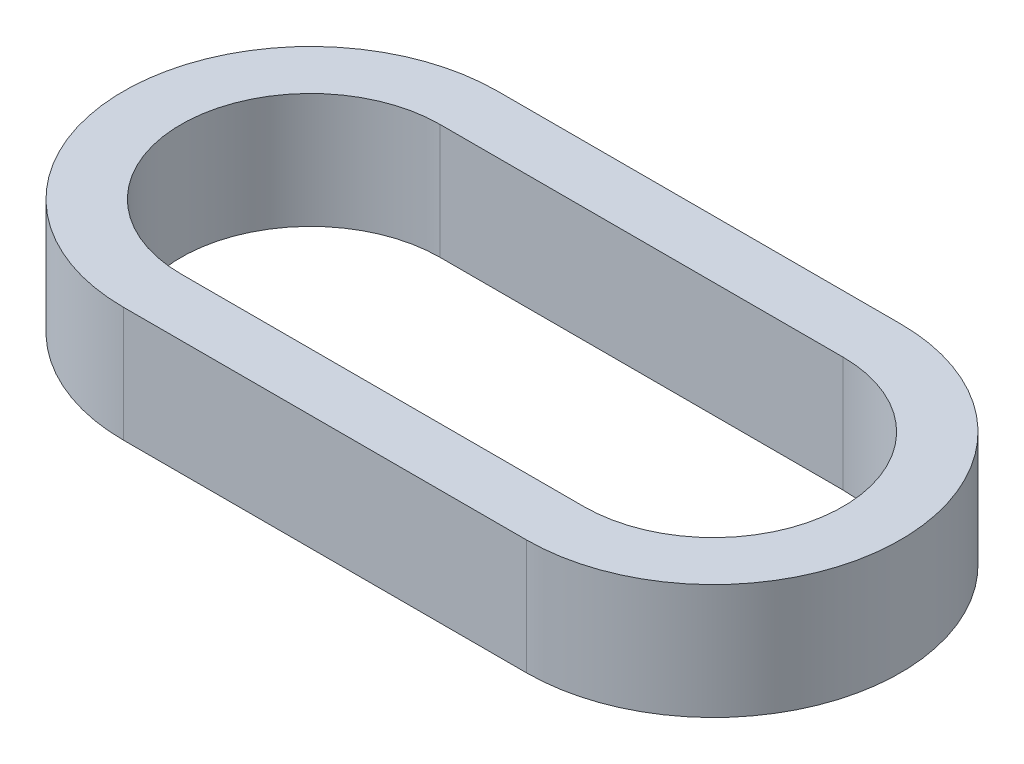
ISO-10303-21;
HEADER;
FILE_DESCRIPTION(('STEP AP214'),'2;1');
FILE_NAME('part.step','',(''),(''),'','','');
FILE_SCHEMA(('AUTOMOTIVE_DESIGN { 1 0 10303 214 1 1 1 1 }'));
ENDSEC;
DATA;
#1=APPLICATION_CONTEXT('core data for automotive mechanical design processes');
#2=APPLICATION_PROTOCOL_DEFINITION('international standard','automotive_design',2000,#1);
#3=PRODUCT_CONTEXT('',#1,'mechanical');
#4=PRODUCT('Part','Part','',(#3));
#5=PRODUCT_RELATED_PRODUCT_CATEGORY('part','',(#4));
#6=PRODUCT_DEFINITION_FORMATION('','',#4);
#7=PRODUCT_DEFINITION_CONTEXT('part definition',#1,'design');
#8=PRODUCT_DEFINITION('design','',#6,#7);
#9=PRODUCT_DEFINITION_SHAPE('','',#8);
#10=(LENGTH_UNIT() NAMED_UNIT(*) SI_UNIT(.MILLI.,.METRE.));
#11=(NAMED_UNIT(*) PLANE_ANGLE_UNIT() SI_UNIT($,.RADIAN.));
#12=(NAMED_UNIT(*) SI_UNIT($,.STERADIAN.) SOLID_ANGLE_UNIT());
#13=UNCERTAINTY_MEASURE_WITH_UNIT(LENGTH_MEASURE(1.E-05),#10,'distance_accuracy_value','');
#14=(GEOMETRIC_REPRESENTATION_CONTEXT(3) GLOBAL_UNCERTAINTY_ASSIGNED_CONTEXT((#13)) GLOBAL_UNIT_ASSIGNED_CONTEXT((#10,
#11,#12)) REPRESENTATION_CONTEXT('',''));
#15=CARTESIAN_POINT('',(0.,0.,0.));
#16=DIRECTION('',(0.,0.,1.));
#17=DIRECTION('',(1.,0.,0.));
#18=AXIS2_PLACEMENT_3D('',#15,#16,#17);
#19=CARTESIAN_POINT('',(-3.5,2.,0.));
#20=DIRECTION('',(0.,1.,0.));
#21=DIRECTION('',(0.,0.,1.));
#22=AXIS2_PLACEMENT_3D('',#19,#20,#21);
#23=PLANE('',#22);
#24=CARTESIAN_POINT('',(-3.5,2.,0.));
#25=DIRECTION('',(0.,1.,0.));
#26=DIRECTION('',(1.,0.,0.));
#27=AXIS2_PLACEMENT_3D('',#24,#25,#26);
#28=CIRCLE('',#27,3.25);
#29=CARTESIAN_POINT('',(-3.5,2.,-3.25));
#30=VERTEX_POINT('',#29);
#31=CARTESIAN_POINT('',(-3.5,2.,3.25));
#32=VERTEX_POINT('',#31);
#33=EDGE_CURVE('E160',#30,#32,#28,.T.);
#34=ORIENTED_EDGE('',*,*,#33,.T.);
#35=DIRECTION('',(1.,0.,0.));
#36=VECTOR('',#35,1.);
#37=CARTESIAN_POINT('',(-3.5,2.,3.25));
#38=LINE('',#37,#36);
#39=CARTESIAN_POINT('',(3.5,2.,3.25));
#40=VERTEX_POINT('',#39);
#41=EDGE_CURVE('E163',#32,#40,#38,.T.);
#42=ORIENTED_EDGE('',*,*,#41,.T.);
#43=CARTESIAN_POINT('',(3.5,2.,0.));
#44=DIRECTION('',(0.,1.,0.));
#45=DIRECTION('',(1.,0.,0.));
#46=AXIS2_PLACEMENT_3D('',#43,#44,#45);
#47=CIRCLE('',#46,3.25);
#48=CARTESIAN_POINT('',(3.5,2.,-3.25));
#49=VERTEX_POINT('',#48);
#50=EDGE_CURVE('E166',#40,#49,#47,.T.);
#51=ORIENTED_EDGE('',*,*,#50,.T.);
#52=DIRECTION('',(-1.,0.,0.));
#53=VECTOR('',#52,1.);
#54=CARTESIAN_POINT('',(-3.5,2.,-3.25));
#55=LINE('',#54,#53);
#56=EDGE_CURVE('E168',#49,#30,#55,.T.);
#57=ORIENTED_EDGE('',*,*,#56,.T.);
#58=EDGE_LOOP('',(#34,#42,#51,#57));
#59=FACE_BOUND('',#58,.T.);
#60=DIRECTION('',(1.,0.,0.));
#61=VECTOR('',#60,1.);
#62=CARTESIAN_POINT('',(-3.5,2.,2.25));
#63=LINE('',#62,#61);
#64=CARTESIAN_POINT('',(-3.5,2.,2.25));
#65=VERTEX_POINT('',#64);
#66=CARTESIAN_POINT('',(3.5,2.,2.25));
#67=VERTEX_POINT('',#66);
#68=EDGE_CURVE('E132',#65,#67,#63,.T.);
#69=ORIENTED_EDGE('',*,*,#68,.F.);
#70=CARTESIAN_POINT('',(-3.5,2.,0.));
#71=DIRECTION('',(0.,1.,0.));
#72=DIRECTION('',(0.,0.,1.));
#73=AXIS2_PLACEMENT_3D('',#70,#71,#72);
#74=CIRCLE('',#73,2.25);
#75=CARTESIAN_POINT('',(-3.5,2.,-2.25));
#76=VERTEX_POINT('',#75);
#77=EDGE_CURVE('E124',#76,#65,#74,.T.);
#78=ORIENTED_EDGE('',*,*,#77,.F.);
#79=DIRECTION('',(-1.,0.,0.));
#80=VECTOR('',#79,1.);
#81=CARTESIAN_POINT('',(-3.5,2.,-2.25));
#82=LINE('',#81,#80);
#83=CARTESIAN_POINT('',(3.5,2.,-2.25));
#84=VERTEX_POINT('',#83);
#85=EDGE_CURVE('E146',#84,#76,#82,.T.);
#86=ORIENTED_EDGE('',*,*,#85,.F.);
#87=CARTESIAN_POINT('',(3.5,2.,0.));
#88=DIRECTION('',(0.,1.,0.));
#89=DIRECTION('',(0.,0.,1.));
#90=AXIS2_PLACEMENT_3D('',#87,#88,#89);
#91=CIRCLE('',#90,2.25);
#92=EDGE_CURVE('E144',#67,#84,#91,.T.);
#93=ORIENTED_EDGE('',*,*,#92,.F.);
#94=EDGE_LOOP('',(#69,#78,#86,#93));
#95=FACE_BOUND('',#94,.T.);
#96=ADVANCED_FACE('F59',(#59,#95),#23,.T.);
#97=CARTESIAN_POINT('',(-3.5,0.,0.));
#98=DIRECTION('',(0.,1.,0.));
#99=DIRECTION('',(0.,0.,1.));
#100=AXIS2_PLACEMENT_3D('',#97,#98,#99);
#101=PLANE('',#100);
#102=CARTESIAN_POINT('',(-3.5,0.,0.));
#103=DIRECTION('',(0.,1.,0.));
#104=DIRECTION('',(1.,0.,0.));
#105=AXIS2_PLACEMENT_3D('',#102,#103,#104);
#106=CIRCLE('',#105,3.25);
#107=CARTESIAN_POINT('',(-3.5,0.,-3.25));
#108=VERTEX_POINT('',#107);
#109=CARTESIAN_POINT('',(-3.5,0.,3.25));
#110=VERTEX_POINT('',#109);
#111=EDGE_CURVE('E140',#108,#110,#106,.T.);
#112=ORIENTED_EDGE('',*,*,#111,.F.);
#113=DIRECTION('',(-1.,0.,0.));
#114=VECTOR('',#113,1.);
#115=CARTESIAN_POINT('',(-3.5,0.,-3.25));
#116=LINE('',#115,#114);
#117=CARTESIAN_POINT('',(3.5,0.,-3.25));
#118=VERTEX_POINT('',#117);
#119=EDGE_CURVE('E164',#118,#108,#116,.T.);
#120=ORIENTED_EDGE('',*,*,#119,.F.);
#121=CARTESIAN_POINT('',(3.5,0.,0.));
#122=DIRECTION('',(0.,1.,0.));
#123=DIRECTION('',(1.,0.,0.));
#124=AXIS2_PLACEMENT_3D('',#121,#122,#123);
#125=CIRCLE('',#124,3.25);
#126=CARTESIAN_POINT('',(3.5,0.,3.25));
#127=VERTEX_POINT('',#126);
#128=EDGE_CURVE('E175',#127,#118,#125,.T.);
#129=ORIENTED_EDGE('',*,*,#128,.F.);
#130=DIRECTION('',(1.,0.,0.));
#131=VECTOR('',#130,1.);
#132=CARTESIAN_POINT('',(-3.5,0.,3.25));
#133=LINE('',#132,#131);
#134=EDGE_CURVE('E173',#110,#127,#133,.T.);
#135=ORIENTED_EDGE('',*,*,#134,.F.);
#136=EDGE_LOOP('',(#112,#120,#129,#135));
#137=FACE_BOUND('',#136,.T.);
#138=CARTESIAN_POINT('',(-3.5,0.,0.));
#139=DIRECTION('',(0.,1.,0.));
#140=DIRECTION('',(0.,0.,1.));
#141=AXIS2_PLACEMENT_3D('',#138,#139,#140);
#142=CIRCLE('',#141,2.25);
#143=CARTESIAN_POINT('',(-3.5,0.,-2.25));
#144=VERTEX_POINT('',#143);
#145=CARTESIAN_POINT('',(-3.5,0.,2.25));
#146=VERTEX_POINT('',#145);
#147=EDGE_CURVE('E82',#144,#146,#142,.T.);
#148=ORIENTED_EDGE('',*,*,#147,.T.);
#149=DIRECTION('',(1.,0.,0.));
#150=VECTOR('',#149,1.);
#151=CARTESIAN_POINT('',(-3.5,0.,2.25));
#152=LINE('',#151,#150);
#153=CARTESIAN_POINT('',(3.5,0.,2.25));
#154=VERTEX_POINT('',#153);
#155=EDGE_CURVE('E139',#146,#154,#152,.T.);
#156=ORIENTED_EDGE('',*,*,#155,.T.);
#157=CARTESIAN_POINT('',(3.5,0.,0.));
#158=DIRECTION('',(0.,1.,0.));
#159=DIRECTION('',(0.,0.,1.));
#160=AXIS2_PLACEMENT_3D('',#157,#158,#159);
#161=CIRCLE('',#160,2.25);
#162=CARTESIAN_POINT('',(3.5,0.,-2.25));
#163=VERTEX_POINT('',#162);
#164=EDGE_CURVE('E152',#154,#163,#161,.T.);
#165=ORIENTED_EDGE('',*,*,#164,.T.);
#166=DIRECTION('',(-1.,0.,0.));
#167=VECTOR('',#166,1.);
#168=CARTESIAN_POINT('',(-3.5,0.,-2.25));
#169=LINE('',#168,#167);
#170=EDGE_CURVE('E133',#163,#144,#169,.T.);
#171=ORIENTED_EDGE('',*,*,#170,.T.);
#172=EDGE_LOOP('',(#148,#156,#165,#171));
#173=FACE_BOUND('',#172,.T.);
#174=ADVANCED_FACE('F193',(#137,#173),#101,.F.);
#175=CARTESIAN_POINT('',(-3.5,2.,0.));
#176=DIRECTION('',(0.,-1.,0.));
#177=DIRECTION('',(0.,0.,-1.));
#178=AXIS2_PLACEMENT_3D('',#175,#176,#177);
#179=CYLINDRICAL_SURFACE('',#178,3.25);
#180=ORIENTED_EDGE('',*,*,#111,.T.);
#181=DIRECTION('',(0.,-1.,0.));
#182=VECTOR('',#181,1.);
#183=CARTESIAN_POINT('',(-3.5,2.,3.25));
#184=LINE('',#183,#182);
#185=EDGE_CURVE('E12',#32,#110,#184,.T.);
#186=ORIENTED_EDGE('',*,*,#185,.F.);
#187=ORIENTED_EDGE('',*,*,#33,.F.);
#188=DIRECTION('',(0.,-1.,0.));
#189=VECTOR('',#188,1.);
#190=CARTESIAN_POINT('',(-3.5,2.,-3.25));
#191=LINE('',#190,#189);
#192=EDGE_CURVE('E170',#30,#108,#191,.T.);
#193=ORIENTED_EDGE('',*,*,#192,.T.);
#194=EDGE_LOOP('',(#180,#186,#187,#193));
#195=FACE_BOUND('',#194,.T.);
#196=ADVANCED_FACE('F61',(#195),#179,.T.);
#197=CARTESIAN_POINT('',(-3.5,2.,3.25));
#198=DIRECTION('',(0.,0.,-1.));
#199=DIRECTION('',(-1.,0.,0.));
#200=AXIS2_PLACEMENT_3D('',#197,#198,#199);
#201=PLANE('',#200);
#202=ORIENTED_EDGE('',*,*,#134,.T.);
#203=DIRECTION('',(0.,-1.,0.));
#204=VECTOR('',#203,1.);
#205=CARTESIAN_POINT('',(3.5,2.,3.25));
#206=LINE('',#205,#204);
#207=EDGE_CURVE('E67',#40,#127,#206,.T.);
#208=ORIENTED_EDGE('',*,*,#207,.F.);
#209=ORIENTED_EDGE('',*,*,#41,.F.);
#210=ORIENTED_EDGE('',*,*,#185,.T.);
#211=EDGE_LOOP('',(#202,#208,#209,#210));
#212=FACE_BOUND('',#211,.T.);
#213=ADVANCED_FACE('F203',(#212),#201,.F.);
#214=CARTESIAN_POINT('',(3.5,2.,0.));
#215=DIRECTION('',(0.,-1.,0.));
#216=DIRECTION('',(0.,0.,-1.));
#217=AXIS2_PLACEMENT_3D('',#214,#215,#216);
#218=CYLINDRICAL_SURFACE('',#217,3.25);
#219=ORIENTED_EDGE('',*,*,#128,.T.);
#220=DIRECTION('',(0.,-1.,0.));
#221=VECTOR('',#220,1.);
#222=CARTESIAN_POINT('',(3.5,2.,-3.25));
#223=LINE('',#222,#221);
#224=EDGE_CURVE('E180',#49,#118,#223,.T.);
#225=ORIENTED_EDGE('',*,*,#224,.F.);
#226=ORIENTED_EDGE('',*,*,#50,.F.);
#227=ORIENTED_EDGE('',*,*,#207,.T.);
#228=EDGE_LOOP('',(#219,#225,#226,#227));
#229=FACE_BOUND('',#228,.T.);
#230=ADVANCED_FACE('F187',(#229),#218,.T.);
#231=CARTESIAN_POINT('',(-3.5,2.,-3.25));
#232=DIRECTION('',(0.,0.,1.));
#233=DIRECTION('',(1.,0.,0.));
#234=AXIS2_PLACEMENT_3D('',#231,#232,#233);
#235=PLANE('',#234);
#236=ORIENTED_EDGE('',*,*,#119,.T.);
#237=ORIENTED_EDGE('',*,*,#192,.F.);
#238=ORIENTED_EDGE('',*,*,#56,.F.);
#239=ORIENTED_EDGE('',*,*,#224,.T.);
#240=EDGE_LOOP('',(#236,#237,#238,#239));
#241=FACE_BOUND('',#240,.T.);
#242=ADVANCED_FACE('F197',(#241),#235,.F.);
#243=CARTESIAN_POINT('',(-3.5,2.,0.));
#244=DIRECTION('',(0.,-1.,0.));
#245=DIRECTION('',(0.,0.,-1.));
#246=AXIS2_PLACEMENT_3D('',#243,#244,#245);
#247=CYLINDRICAL_SURFACE('',#246,2.25);
#248=ORIENTED_EDGE('',*,*,#147,.F.);
#249=DIRECTION('',(0.,-1.,0.));
#250=VECTOR('',#249,1.);
#251=CARTESIAN_POINT('',(-3.5,2.,-2.25));
#252=LINE('',#251,#250);
#253=EDGE_CURVE('E128',#76,#144,#252,.T.);
#254=ORIENTED_EDGE('',*,*,#253,.F.);
#255=ORIENTED_EDGE('',*,*,#77,.T.);
#256=DIRECTION('',(0.,-1.,0.));
#257=VECTOR('',#256,1.);
#258=CARTESIAN_POINT('',(-3.5,2.,2.25));
#259=LINE('',#258,#257);
#260=EDGE_CURVE('E127',#65,#146,#259,.T.);
#261=ORIENTED_EDGE('',*,*,#260,.T.);
#262=EDGE_LOOP('',(#248,#254,#255,#261));
#263=FACE_BOUND('',#262,.T.);
#264=ADVANCED_FACE('F126',(#263),#247,.F.);
#265=CARTESIAN_POINT('',(-3.5,2.,2.25));
#266=DIRECTION('',(0.,0.,-1.));
#267=DIRECTION('',(-1.,0.,0.));
#268=AXIS2_PLACEMENT_3D('',#265,#266,#267);
#269=PLANE('',#268);
#270=ORIENTED_EDGE('',*,*,#155,.F.);
#271=ORIENTED_EDGE('',*,*,#260,.F.);
#272=ORIENTED_EDGE('',*,*,#68,.T.);
#273=DIRECTION('',(0.,-1.,0.));
#274=VECTOR('',#273,1.);
#275=CARTESIAN_POINT('',(3.5,2.,2.25));
#276=LINE('',#275,#274);
#277=EDGE_CURVE('E141',#67,#154,#276,.T.);
#278=ORIENTED_EDGE('',*,*,#277,.T.);
#279=EDGE_LOOP('',(#270,#271,#272,#278));
#280=FACE_BOUND('',#279,.T.);
#281=ADVANCED_FACE('F136',(#280),#269,.T.);
#282=CARTESIAN_POINT('',(3.5,2.,0.));
#283=DIRECTION('',(0.,-1.,0.));
#284=DIRECTION('',(0.,0.,-1.));
#285=AXIS2_PLACEMENT_3D('',#282,#283,#284);
#286=CYLINDRICAL_SURFACE('',#285,2.25);
#287=ORIENTED_EDGE('',*,*,#164,.F.);
#288=ORIENTED_EDGE('',*,*,#277,.F.);
#289=ORIENTED_EDGE('',*,*,#92,.T.);
#290=DIRECTION('',(0.,-1.,0.));
#291=VECTOR('',#290,1.);
#292=CARTESIAN_POINT('',(3.5,2.,-2.25));
#293=LINE('',#292,#291);
#294=EDGE_CURVE('E74',#84,#163,#293,.T.);
#295=ORIENTED_EDGE('',*,*,#294,.T.);
#296=EDGE_LOOP('',(#287,#288,#289,#295));
#297=FACE_BOUND('',#296,.T.);
#298=ADVANCED_FACE('F226',(#297),#286,.F.);
#299=CARTESIAN_POINT('',(-3.5,2.,-2.25));
#300=DIRECTION('',(0.,0.,1.));
#301=DIRECTION('',(1.,0.,0.));
#302=AXIS2_PLACEMENT_3D('',#299,#300,#301);
#303=PLANE('',#302);
#304=ORIENTED_EDGE('',*,*,#170,.F.);
#305=ORIENTED_EDGE('',*,*,#294,.F.);
#306=ORIENTED_EDGE('',*,*,#85,.T.);
#307=ORIENTED_EDGE('',*,*,#253,.T.);
#308=EDGE_LOOP('',(#304,#305,#306,#307));
#309=FACE_BOUND('',#308,.T.);
#310=ADVANCED_FACE('F230',(#309),#303,.T.);
#311=CLOSED_SHELL('',(#96,#174,#196,#213,#230,#242,#264,#281,#298,#310));
#312=MANIFOLD_SOLID_BREP('B2',#311);
#313=ADVANCED_BREP_SHAPE_REPRESENTATION('',(#18,#312),#14);
#314=SHAPE_DEFINITION_REPRESENTATION(#9,#313);
ENDSEC;
END-ISO-10303-21;
